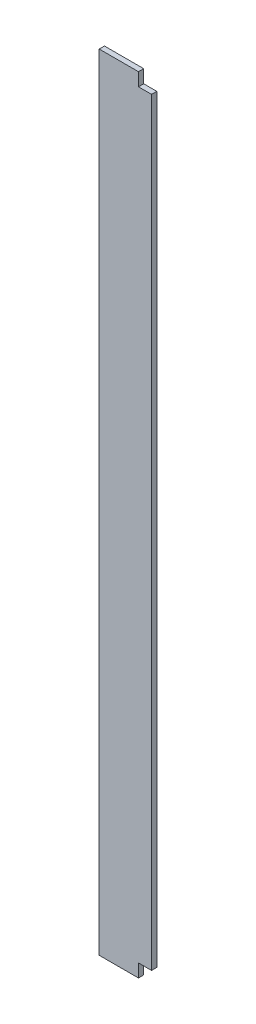
ISO-10303-21;
HEADER;
FILE_DESCRIPTION(('STEP AP214'),'2;1');
FILE_NAME('part.step','',(''),(''),'','','');
FILE_SCHEMA(('AUTOMOTIVE_DESIGN { 1 0 10303 214 1 1 1 1 }'));
ENDSEC;
DATA;
#1=APPLICATION_CONTEXT('core data for automotive mechanical design processes');
#2=APPLICATION_PROTOCOL_DEFINITION('international standard','automotive_design',2000,#1);
#3=PRODUCT_CONTEXT('',#1,'mechanical');
#4=PRODUCT('Part','Part','',(#3));
#5=PRODUCT_RELATED_PRODUCT_CATEGORY('part','',(#4));
#6=PRODUCT_DEFINITION_FORMATION('','',#4);
#7=PRODUCT_DEFINITION_CONTEXT('part definition',#1,'design');
#8=PRODUCT_DEFINITION('design','',#6,#7);
#9=PRODUCT_DEFINITION_SHAPE('','',#8);
#10=(LENGTH_UNIT() NAMED_UNIT(*) SI_UNIT(.MILLI.,.METRE.));
#11=(NAMED_UNIT(*) PLANE_ANGLE_UNIT() SI_UNIT($,.RADIAN.));
#12=(NAMED_UNIT(*) SI_UNIT($,.STERADIAN.) SOLID_ANGLE_UNIT());
#13=UNCERTAINTY_MEASURE_WITH_UNIT(LENGTH_MEASURE(1.E-05),#10,'distance_accuracy_value','');
#14=(GEOMETRIC_REPRESENTATION_CONTEXT(3) GLOBAL_UNCERTAINTY_ASSIGNED_CONTEXT((#13)) GLOBAL_UNIT_ASSIGNED_CONTEXT((#10,
#11,#12)) REPRESENTATION_CONTEXT('',''));
#15=CARTESIAN_POINT('',(0.,0.,0.));
#16=DIRECTION('',(0.,0.,1.));
#17=DIRECTION('',(1.,0.,0.));
#18=AXIS2_PLACEMENT_3D('',#15,#16,#17);
#19=CARTESIAN_POINT('',(-1156.48368854433,3000.,-804.687242443019));
#20=DIRECTION('',(1.,0.,0.));
#21=DIRECTION('',(0.,0.,-1.));
#22=AXIS2_PLACEMENT_3D('',#19,#20,#21);
#23=PLANE('',#22);
#24=DIRECTION('',(0.,0.,1.));
#25=VECTOR('',#24,1.);
#26=CARTESIAN_POINT('',(-1156.48368854433,0.,-804.687242443019));
#27=LINE('',#26,#25);
#28=CARTESIAN_POINT('',(-1156.48368854433,0.,-804.687242443019));
#29=VERTEX_POINT('',#28);
#30=CARTESIAN_POINT('',(-1156.48368854433,0.,-784.687242443019));
#31=VERTEX_POINT('',#30);
#32=EDGE_CURVE('E154',#29,#31,#27,.T.);
#33=ORIENTED_EDGE('',*,*,#32,.T.);
#34=DIRECTION('',(0.,-1.,0.));
#35=VECTOR('',#34,1.);
#36=CARTESIAN_POINT('',(-1156.48368854433,3000.,-784.687242443019));
#37=LINE('',#36,#35);
#38=CARTESIAN_POINT('',(-1156.48368854433,3000.,-784.687242443019));
#39=VERTEX_POINT('',#38);
#40=EDGE_CURVE('E11',#39,#31,#37,.T.);
#41=ORIENTED_EDGE('',*,*,#40,.F.);
#42=DIRECTION('',(0.,0.,1.));
#43=VECTOR('',#42,1.);
#44=CARTESIAN_POINT('',(-1156.48368854433,3000.,-804.687242443019));
#45=LINE('',#44,#43);
#46=CARTESIAN_POINT('',(-1156.48368854433,3000.,-804.687242443019));
#47=VERTEX_POINT('',#46);
#48=EDGE_CURVE('E161',#47,#39,#45,.T.);
#49=ORIENTED_EDGE('',*,*,#48,.F.);
#50=DIRECTION('',(0.,-1.,0.));
#51=VECTOR('',#50,1.);
#52=CARTESIAN_POINT('',(-1156.48368854433,3000.,-804.687242443019));
#53=LINE('',#52,#51);
#54=EDGE_CURVE('E172',#47,#29,#53,.T.);
#55=ORIENTED_EDGE('',*,*,#54,.T.);
#56=EDGE_LOOP('',(#33,#41,#49,#55));
#57=FACE_BOUND('',#56,.T.);
#58=ADVANCED_FACE('F38',(#57),#23,.F.);
#59=CARTESIAN_POINT('',(-1156.48368854433,3000.,-784.687242443019));
#60=DIRECTION('',(0.,0.,-1.));
#61=DIRECTION('',(-1.,0.,0.));
#62=AXIS2_PLACEMENT_3D('',#59,#60,#61);
#63=PLANE('',#62);
#64=DIRECTION('',(0.,-1.,0.));
#65=VECTOR('',#64,1.);
#66=CARTESIAN_POINT('',(-956.483688544326,3000.,-784.687242443019));
#67=LINE('',#66,#65);
#68=CARTESIAN_POINT('',(-956.483688544326,2950.,-784.687242443019));
#69=VERTEX_POINT('',#68);
#70=CARTESIAN_POINT('',(-956.483688544326,50.,-784.687242443019));
#71=VERTEX_POINT('',#70);
#72=EDGE_CURVE('E46',#69,#71,#67,.T.);
#73=ORIENTED_EDGE('',*,*,#72,.F.);
#74=DIRECTION('',(1.,0.,0.));
#75=VECTOR('',#74,1.);
#76=CARTESIAN_POINT('',(-956.483688544326,2950.,-784.687242443019));
#77=LINE('',#76,#75);
#78=CARTESIAN_POINT('',(-1006.48368854433,2950.,-784.687242443019));
#79=VERTEX_POINT('',#78);
#80=EDGE_CURVE('E125',#79,#69,#77,.T.);
#81=ORIENTED_EDGE('',*,*,#80,.F.);
#82=DIRECTION('',(0.,-1.,0.));
#83=VECTOR('',#82,1.);
#84=CARTESIAN_POINT('',(-1006.48368854433,3000.,-784.687242443019));
#85=LINE('',#84,#83);
#86=CARTESIAN_POINT('',(-1006.48368854433,3000.,-784.687242443019));
#87=VERTEX_POINT('',#86);
#88=EDGE_CURVE('E105',#87,#79,#85,.T.);
#89=ORIENTED_EDGE('',*,*,#88,.F.);
#90=DIRECTION('',(1.,0.,0.));
#91=VECTOR('',#90,1.);
#92=CARTESIAN_POINT('',(-1156.48368854433,3000.,-784.687242443019));
#93=LINE('',#92,#91);
#94=EDGE_CURVE('E165',#39,#87,#93,.T.);
#95=ORIENTED_EDGE('',*,*,#94,.F.);
#96=ORIENTED_EDGE('',*,*,#40,.T.);
#97=DIRECTION('',(1.,0.,0.));
#98=VECTOR('',#97,1.);
#99=CARTESIAN_POINT('',(-1156.48368854433,0.,-784.687242443019));
#100=LINE('',#99,#98);
#101=CARTESIAN_POINT('',(-1006.48368854433,0.,-784.687242443019));
#102=VERTEX_POINT('',#101);
#103=EDGE_CURVE('E176',#31,#102,#100,.T.);
#104=ORIENTED_EDGE('',*,*,#103,.T.);
#105=DIRECTION('',(0.,-1.,0.));
#106=VECTOR('',#105,1.);
#107=CARTESIAN_POINT('',(-1006.48368854433,0.,-784.687242443019));
#108=LINE('',#107,#106);
#109=CARTESIAN_POINT('',(-1006.48368854433,50.,-784.687242443019));
#110=VERTEX_POINT('',#109);
#111=EDGE_CURVE('E61',#110,#102,#108,.T.);
#112=ORIENTED_EDGE('',*,*,#111,.F.);
#113=DIRECTION('',(-1.,0.,0.));
#114=VECTOR('',#113,1.);
#115=CARTESIAN_POINT('',(-956.483688544326,50.,-784.687242443019));
#116=LINE('',#115,#114);
#117=EDGE_CURVE('E133',#71,#110,#116,.T.);
#118=ORIENTED_EDGE('',*,*,#117,.F.);
#119=EDGE_LOOP('',(#73,#81,#89,#95,#96,#104,#112,#118));
#120=FACE_BOUND('',#119,.T.);
#121=ADVANCED_FACE('F197',(#120),#63,.F.);
#122=CARTESIAN_POINT('',(-956.483688544326,3000.,-804.687242443019));
#123=DIRECTION('',(1.,0.,0.));
#124=DIRECTION('',(0.,0.,-1.));
#125=AXIS2_PLACEMENT_3D('',#122,#123,#124);
#126=PLANE('',#125);
#127=DIRECTION('',(0.,0.,1.));
#128=VECTOR('',#127,1.);
#129=CARTESIAN_POINT('',(-956.483688544326,2950.,-804.687242443019));
#130=LINE('',#129,#128);
#131=CARTESIAN_POINT('',(-956.483688544326,2950.,-804.687242443019));
#132=VERTEX_POINT('',#131);
#133=EDGE_CURVE('E109',#132,#69,#130,.T.);
#134=ORIENTED_EDGE('',*,*,#133,.T.);
#135=ORIENTED_EDGE('',*,*,#72,.T.);
#136=DIRECTION('',(0.,0.,1.));
#137=VECTOR('',#136,1.);
#138=CARTESIAN_POINT('',(-956.483688544326,50.,-804.687242443019));
#139=LINE('',#138,#137);
#140=CARTESIAN_POINT('',(-956.483688544326,50.,-804.687242443019));
#141=VERTEX_POINT('',#140);
#142=EDGE_CURVE('E145',#141,#71,#139,.T.);
#143=ORIENTED_EDGE('',*,*,#142,.F.);
#144=DIRECTION('',(0.,-1.,0.));
#145=VECTOR('',#144,1.);
#146=CARTESIAN_POINT('',(-956.483688544326,3000.,-804.687242443019));
#147=LINE('',#146,#145);
#148=EDGE_CURVE('E185',#132,#141,#147,.T.);
#149=ORIENTED_EDGE('',*,*,#148,.F.);
#150=EDGE_LOOP('',(#134,#135,#143,#149));
#151=FACE_BOUND('',#150,.T.);
#152=ADVANCED_FACE('F191',(#151),#126,.T.);
#153=CARTESIAN_POINT('',(-1156.48368854433,3000.,-804.687242443019));
#154=DIRECTION('',(0.,0.,-1.));
#155=DIRECTION('',(-1.,0.,0.));
#156=AXIS2_PLACEMENT_3D('',#153,#154,#155);
#157=PLANE('',#156);
#158=DIRECTION('',(1.,0.,0.));
#159=VECTOR('',#158,1.);
#160=CARTESIAN_POINT('',(-956.483688544326,2950.,-804.687242443019));
#161=LINE('',#160,#159);
#162=CARTESIAN_POINT('',(-1006.48368854433,2950.,-804.687242443019));
#163=VERTEX_POINT('',#162);
#164=EDGE_CURVE('E113',#163,#132,#161,.T.);
#165=ORIENTED_EDGE('',*,*,#164,.T.);
#166=ORIENTED_EDGE('',*,*,#148,.T.);
#167=DIRECTION('',(-1.,0.,0.));
#168=VECTOR('',#167,1.);
#169=CARTESIAN_POINT('',(-956.483688544326,50.,-804.687242443019));
#170=LINE('',#169,#168);
#171=CARTESIAN_POINT('',(-1006.48368854433,50.,-804.687242443019));
#172=VERTEX_POINT('',#171);
#173=EDGE_CURVE('E137',#141,#172,#170,.T.);
#174=ORIENTED_EDGE('',*,*,#173,.T.);
#175=DIRECTION('',(0.,-1.,0.));
#176=VECTOR('',#175,1.);
#177=CARTESIAN_POINT('',(-1006.48368854433,0.,-804.687242443019));
#178=LINE('',#177,#176);
#179=CARTESIAN_POINT('',(-1006.48368854433,0.,-804.687242443019));
#180=VERTEX_POINT('',#179);
#181=EDGE_CURVE('E141',#172,#180,#178,.T.);
#182=ORIENTED_EDGE('',*,*,#181,.T.);
#183=DIRECTION('',(1.,0.,0.));
#184=VECTOR('',#183,1.);
#185=CARTESIAN_POINT('',(-1156.48368854433,0.,-804.687242443019));
#186=LINE('',#185,#184);
#187=EDGE_CURVE('E166',#29,#180,#186,.T.);
#188=ORIENTED_EDGE('',*,*,#187,.F.);
#189=ORIENTED_EDGE('',*,*,#54,.F.);
#190=DIRECTION('',(1.,0.,0.));
#191=VECTOR('',#190,1.);
#192=CARTESIAN_POINT('',(-1156.48368854433,3000.,-804.687242443019));
#193=LINE('',#192,#191);
#194=CARTESIAN_POINT('',(-1006.48368854433,3000.,-804.687242443019));
#195=VERTEX_POINT('',#194);
#196=EDGE_CURVE('E123',#47,#195,#193,.T.);
#197=ORIENTED_EDGE('',*,*,#196,.T.);
#198=DIRECTION('',(0.,-1.,0.));
#199=VECTOR('',#198,1.);
#200=CARTESIAN_POINT('',(-1006.48368854433,3000.,-804.687242443019));
#201=LINE('',#200,#199);
#202=EDGE_CURVE('E53',#195,#163,#201,.T.);
#203=ORIENTED_EDGE('',*,*,#202,.T.);
#204=EDGE_LOOP('',(#165,#166,#174,#182,#188,#189,#197,#203));
#205=FACE_BOUND('',#204,.T.);
#206=ADVANCED_FACE('F121',(#205),#157,.T.);
#207=CARTESIAN_POINT('',(0.,3000.,0.));
#208=DIRECTION('',(0.,1.,0.));
#209=DIRECTION('',(0.,0.,1.));
#210=AXIS2_PLACEMENT_3D('',#207,#208,#209);
#211=PLANE('',#210);
#212=DIRECTION('',(0.,0.,1.));
#213=VECTOR('',#212,1.);
#214=CARTESIAN_POINT('',(-1006.48368854433,3000.,-804.687242443019));
#215=LINE('',#214,#213);
#216=EDGE_CURVE('E110',#195,#87,#215,.T.);
#217=ORIENTED_EDGE('',*,*,#216,.F.);
#218=ORIENTED_EDGE('',*,*,#196,.F.);
#219=ORIENTED_EDGE('',*,*,#48,.T.);
#220=ORIENTED_EDGE('',*,*,#94,.T.);
#221=EDGE_LOOP('',(#217,#218,#219,#220));
#222=FACE_BOUND('',#221,.T.);
#223=ADVANCED_FACE('F208',(#222),#211,.T.);
#224=CARTESIAN_POINT('',(0.,0.,0.));
#225=DIRECTION('',(0.,1.,0.));
#226=DIRECTION('',(0.,0.,1.));
#227=AXIS2_PLACEMENT_3D('',#224,#225,#226);
#228=PLANE('',#227);
#229=ORIENTED_EDGE('',*,*,#187,.T.);
#230=DIRECTION('',(0.,0.,1.));
#231=VECTOR('',#230,1.);
#232=CARTESIAN_POINT('',(-1006.48368854433,0.,-804.687242443019));
#233=LINE('',#232,#231);
#234=EDGE_CURVE('E151',#180,#102,#233,.T.);
#235=ORIENTED_EDGE('',*,*,#234,.T.);
#236=ORIENTED_EDGE('',*,*,#103,.F.);
#237=ORIENTED_EDGE('',*,*,#32,.F.);
#238=EDGE_LOOP('',(#229,#235,#236,#237));
#239=FACE_BOUND('',#238,.T.);
#240=ADVANCED_FACE('F201',(#239),#228,.F.);
#241=CARTESIAN_POINT('',(-1006.48368854433,0.,-804.687242443019));
#242=DIRECTION('',(-1.,0.,0.));
#243=DIRECTION('',(0.,0.,1.));
#244=AXIS2_PLACEMENT_3D('',#241,#242,#243);
#245=PLANE('',#244);
#246=ORIENTED_EDGE('',*,*,#111,.T.);
#247=ORIENTED_EDGE('',*,*,#234,.F.);
#248=ORIENTED_EDGE('',*,*,#181,.F.);
#249=DIRECTION('',(0.,0.,1.));
#250=VECTOR('',#249,1.);
#251=CARTESIAN_POINT('',(-1006.48368854433,50.,-804.687242443019));
#252=LINE('',#251,#250);
#253=EDGE_CURVE('E155',#172,#110,#252,.T.);
#254=ORIENTED_EDGE('',*,*,#253,.T.);
#255=EDGE_LOOP('',(#246,#247,#248,#254));
#256=FACE_BOUND('',#255,.T.);
#257=ADVANCED_FACE('F204',(#256),#245,.F.);
#258=CARTESIAN_POINT('',(-956.483688544326,50.,-804.687242443019));
#259=DIRECTION('',(0.,1.,0.));
#260=DIRECTION('',(-1.,0.,0.));
#261=AXIS2_PLACEMENT_3D('',#258,#259,#260);
#262=PLANE('',#261);
#263=ORIENTED_EDGE('',*,*,#117,.T.);
#264=ORIENTED_EDGE('',*,*,#253,.F.);
#265=ORIENTED_EDGE('',*,*,#173,.F.);
#266=ORIENTED_EDGE('',*,*,#142,.T.);
#267=EDGE_LOOP('',(#263,#264,#265,#266));
#268=FACE_BOUND('',#267,.T.);
#269=ADVANCED_FACE('F196',(#268),#262,.F.);
#270=CARTESIAN_POINT('',(-956.483688544326,2950.,-804.687242443019));
#271=DIRECTION('',(0.,-1.,0.));
#272=DIRECTION('',(0.,0.,-1.));
#273=AXIS2_PLACEMENT_3D('',#270,#271,#272);
#274=PLANE('',#273);
#275=ORIENTED_EDGE('',*,*,#80,.T.);
#276=ORIENTED_EDGE('',*,*,#133,.F.);
#277=ORIENTED_EDGE('',*,*,#164,.F.);
#278=DIRECTION('',(0.,0.,1.));
#279=VECTOR('',#278,1.);
#280=CARTESIAN_POINT('',(-1006.48368854433,2950.,-804.687242443019));
#281=LINE('',#280,#279);
#282=EDGE_CURVE('E101',#163,#79,#281,.T.);
#283=ORIENTED_EDGE('',*,*,#282,.T.);
#284=EDGE_LOOP('',(#275,#276,#277,#283));
#285=FACE_BOUND('',#284,.T.);
#286=ADVANCED_FACE('F114',(#285),#274,.F.);
#287=CARTESIAN_POINT('',(-1006.48368854433,3000.,-804.687242443019));
#288=DIRECTION('',(-1.,0.,0.));
#289=DIRECTION('',(0.,0.,1.));
#290=AXIS2_PLACEMENT_3D('',#287,#288,#289);
#291=PLANE('',#290);
#292=ORIENTED_EDGE('',*,*,#88,.T.);
#293=ORIENTED_EDGE('',*,*,#282,.F.);
#294=ORIENTED_EDGE('',*,*,#202,.F.);
#295=ORIENTED_EDGE('',*,*,#216,.T.);
#296=EDGE_LOOP('',(#292,#293,#294,#295));
#297=FACE_BOUND('',#296,.T.);
#298=ADVANCED_FACE('F103',(#297),#291,.F.);
#299=CLOSED_SHELL('',(#58,#121,#152,#206,#223,#240,#257,#269,#286,#298));
#300=MANIFOLD_SOLID_BREP('B2',#299);
#301=ADVANCED_BREP_SHAPE_REPRESENTATION('',(#18,#300),#14);
#302=SHAPE_DEFINITION_REPRESENTATION(#9,#301);
ENDSEC;
END-ISO-10303-21;
